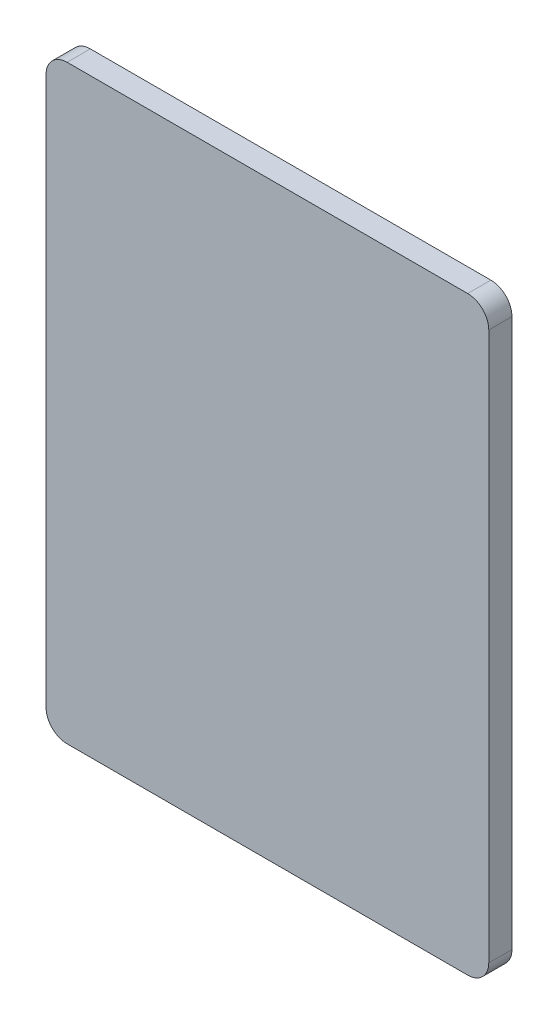
ISO-10303-21;
HEADER;
FILE_DESCRIPTION(('STEP AP214'),'2;1');
FILE_NAME('part.step','',(''),(''),'','','');
FILE_SCHEMA(('AUTOMOTIVE_DESIGN { 1 0 10303 214 1 1 1 1 }'));
ENDSEC;
DATA;
#1=APPLICATION_CONTEXT('core data for automotive mechanical design processes');
#2=APPLICATION_PROTOCOL_DEFINITION('international standard','automotive_design',2000,#1);
#3=PRODUCT_CONTEXT('',#1,'mechanical');
#4=PRODUCT('Part','Part','',(#3));
#5=PRODUCT_RELATED_PRODUCT_CATEGORY('part','',(#4));
#6=PRODUCT_DEFINITION_FORMATION('','',#4);
#7=PRODUCT_DEFINITION_CONTEXT('part definition',#1,'design');
#8=PRODUCT_DEFINITION('design','',#6,#7);
#9=PRODUCT_DEFINITION_SHAPE('','',#8);
#10=(LENGTH_UNIT() NAMED_UNIT(*) SI_UNIT(.MILLI.,.METRE.));
#11=(NAMED_UNIT(*) PLANE_ANGLE_UNIT() SI_UNIT($,.RADIAN.));
#12=(NAMED_UNIT(*) SI_UNIT($,.STERADIAN.) SOLID_ANGLE_UNIT());
#13=UNCERTAINTY_MEASURE_WITH_UNIT(LENGTH_MEASURE(1.E-05),#10,'distance_accuracy_value','');
#14=(GEOMETRIC_REPRESENTATION_CONTEXT(3) GLOBAL_UNCERTAINTY_ASSIGNED_CONTEXT((#13)) GLOBAL_UNIT_ASSIGNED_CONTEXT((#10,
#11,#12)) REPRESENTATION_CONTEXT('',''));
#15=CARTESIAN_POINT('',(0.,0.,0.));
#16=DIRECTION('',(0.,0.,1.));
#17=DIRECTION('',(1.,0.,0.));
#18=AXIS2_PLACEMENT_3D('',#15,#16,#17);
#19=CARTESIAN_POINT('',(105.,140.,11.));
#20=DIRECTION('',(-1.,0.,0.));
#21=DIRECTION('',(0.,0.,1.));
#22=AXIS2_PLACEMENT_3D('',#19,#20,#21);
#23=PLANE('',#22);
#24=DIRECTION('',(0.,1.,0.));
#25=VECTOR('',#24,1.);
#26=CARTESIAN_POINT('',(105.,140.,0.));
#27=LINE('',#26,#25);
#28=CARTESIAN_POINT('',(105.,-130.,0.));
#29=VERTEX_POINT('',#28);
#30=CARTESIAN_POINT('',(105.,130.,0.));
#31=VERTEX_POINT('',#30);
#32=EDGE_CURVE('E157',#29,#31,#27,.T.);
#33=ORIENTED_EDGE('',*,*,#32,.T.);
#34=DIRECTION('',(0.,0.,-1.));
#35=VECTOR('',#34,1.);
#36=CARTESIAN_POINT('',(105.,130.,11.));
#37=LINE('',#36,#35);
#38=CARTESIAN_POINT('',(105.,130.,11.));
#39=VERTEX_POINT('',#38);
#40=EDGE_CURVE('E11',#31,#39,#37,.F.);
#41=ORIENTED_EDGE('',*,*,#40,.T.);
#42=DIRECTION('',(0.,1.,0.));
#43=VECTOR('',#42,1.);
#44=CARTESIAN_POINT('',(105.,140.,11.));
#45=LINE('',#44,#43);
#46=CARTESIAN_POINT('',(105.,-130.,11.));
#47=VERTEX_POINT('',#46);
#48=EDGE_CURVE('E125',#47,#39,#45,.T.);
#49=ORIENTED_EDGE('',*,*,#48,.F.);
#50=DIRECTION('',(0.,0.,-1.));
#51=VECTOR('',#50,1.);
#52=CARTESIAN_POINT('',(105.,-130.,11.));
#53=LINE('',#52,#51);
#54=EDGE_CURVE('E41',#47,#29,#53,.T.);
#55=ORIENTED_EDGE('',*,*,#54,.T.);
#56=EDGE_LOOP('',(#33,#41,#49,#55));
#57=FACE_BOUND('',#56,.T.);
#58=ADVANCED_FACE('F33',(#57),#23,.F.);
#59=CARTESIAN_POINT('',(-105.,140.,11.));
#60=DIRECTION('',(0.,-1.,0.));
#61=DIRECTION('',(0.,0.,-1.));
#62=AXIS2_PLACEMENT_3D('',#59,#60,#61);
#63=PLANE('',#62);
#64=DIRECTION('',(-1.,0.,0.));
#65=VECTOR('',#64,1.);
#66=CARTESIAN_POINT('',(-105.,140.,0.));
#67=LINE('',#66,#65);
#68=CARTESIAN_POINT('',(95.,140.,0.));
#69=VERTEX_POINT('',#68);
#70=CARTESIAN_POINT('',(-95.,140.,0.));
#71=VERTEX_POINT('',#70);
#72=EDGE_CURVE('E130',#69,#71,#67,.T.);
#73=ORIENTED_EDGE('',*,*,#72,.T.);
#74=DIRECTION('',(0.,0.,-1.));
#75=VECTOR('',#74,1.);
#76=CARTESIAN_POINT('',(-95.,140.,11.));
#77=LINE('',#76,#75);
#78=CARTESIAN_POINT('',(-95.,140.,11.));
#79=VERTEX_POINT('',#78);
#80=EDGE_CURVE('E48',#71,#79,#77,.F.);
#81=ORIENTED_EDGE('',*,*,#80,.T.);
#82=DIRECTION('',(-1.,0.,0.));
#83=VECTOR('',#82,1.);
#84=CARTESIAN_POINT('',(-105.,140.,11.));
#85=LINE('',#84,#83);
#86=CARTESIAN_POINT('',(95.,140.,11.));
#87=VERTEX_POINT('',#86);
#88=EDGE_CURVE('E128',#87,#79,#85,.T.);
#89=ORIENTED_EDGE('',*,*,#88,.F.);
#90=DIRECTION('',(0.,0.,-1.));
#91=VECTOR('',#90,1.);
#92=CARTESIAN_POINT('',(95.,140.,11.));
#93=LINE('',#92,#91);
#94=EDGE_CURVE('E149',#87,#69,#93,.T.);
#95=ORIENTED_EDGE('',*,*,#94,.T.);
#96=EDGE_LOOP('',(#73,#81,#89,#95));
#97=FACE_BOUND('',#96,.T.);
#98=ADVANCED_FACE('F177',(#97),#63,.F.);
#99=CARTESIAN_POINT('',(-105.,140.,11.));
#100=DIRECTION('',(1.,0.,0.));
#101=DIRECTION('',(0.,1.,0.));
#102=AXIS2_PLACEMENT_3D('',#99,#100,#101);
#103=PLANE('',#102);
#104=DIRECTION('',(0.,-1.,0.));
#105=VECTOR('',#104,1.);
#106=CARTESIAN_POINT('',(-105.,140.,0.));
#107=LINE('',#106,#105);
#108=CARTESIAN_POINT('',(-105.,130.,0.));
#109=VERTEX_POINT('',#108);
#110=CARTESIAN_POINT('',(-105.,-130.,0.));
#111=VERTEX_POINT('',#110);
#112=EDGE_CURVE('E126',#109,#111,#107,.T.);
#113=ORIENTED_EDGE('',*,*,#112,.T.);
#114=DIRECTION('',(0.,0.,-1.));
#115=VECTOR('',#114,1.);
#116=CARTESIAN_POINT('',(-105.,-130.,11.));
#117=LINE('',#116,#115);
#118=CARTESIAN_POINT('',(-105.,-130.,11.));
#119=VERTEX_POINT('',#118);
#120=EDGE_CURVE('E104',#111,#119,#117,.F.);
#121=ORIENTED_EDGE('',*,*,#120,.T.);
#122=DIRECTION('',(0.,-1.,0.));
#123=VECTOR('',#122,1.);
#124=CARTESIAN_POINT('',(-105.,140.,11.));
#125=LINE('',#124,#123);
#126=CARTESIAN_POINT('',(-105.,130.,11.));
#127=VERTEX_POINT('',#126);
#128=EDGE_CURVE('E165',#127,#119,#125,.T.);
#129=ORIENTED_EDGE('',*,*,#128,.F.);
#130=DIRECTION('',(0.,0.,-1.));
#131=VECTOR('',#130,1.);
#132=CARTESIAN_POINT('',(-105.,130.,11.));
#133=LINE('',#132,#131);
#134=EDGE_CURVE('E109',#127,#109,#133,.T.);
#135=ORIENTED_EDGE('',*,*,#134,.T.);
#136=EDGE_LOOP('',(#113,#121,#129,#135));
#137=FACE_BOUND('',#136,.T.);
#138=ADVANCED_FACE('F176',(#137),#103,.F.);
#139=CARTESIAN_POINT('',(-105.,-140.,11.));
#140=DIRECTION('',(0.,1.,0.));
#141=DIRECTION('',(0.,0.,1.));
#142=AXIS2_PLACEMENT_3D('',#139,#140,#141);
#143=PLANE('',#142);
#144=DIRECTION('',(1.,0.,0.));
#145=VECTOR('',#144,1.);
#146=CARTESIAN_POINT('',(-105.,-140.,11.));
#147=LINE('',#146,#145);
#148=CARTESIAN_POINT('',(-95.,-140.,11.));
#149=VERTEX_POINT('',#148);
#150=CARTESIAN_POINT('',(95.,-140.,11.));
#151=VERTEX_POINT('',#150);
#152=EDGE_CURVE('E119',#149,#151,#147,.T.);
#153=ORIENTED_EDGE('',*,*,#152,.F.);
#154=DIRECTION('',(0.,0.,-1.));
#155=VECTOR('',#154,1.);
#156=CARTESIAN_POINT('',(-95.,-140.,11.));
#157=LINE('',#156,#155);
#158=CARTESIAN_POINT('',(-95.,-140.,0.));
#159=VERTEX_POINT('',#158);
#160=EDGE_CURVE('E103',#149,#159,#157,.T.);
#161=ORIENTED_EDGE('',*,*,#160,.T.);
#162=DIRECTION('',(1.,0.,0.));
#163=VECTOR('',#162,1.);
#164=CARTESIAN_POINT('',(-105.,-140.,0.));
#165=LINE('',#164,#163);
#166=CARTESIAN_POINT('',(95.,-140.,0.));
#167=VERTEX_POINT('',#166);
#168=EDGE_CURVE('E116',#159,#167,#165,.T.);
#169=ORIENTED_EDGE('',*,*,#168,.T.);
#170=DIRECTION('',(0.,0.,-1.));
#171=VECTOR('',#170,1.);
#172=CARTESIAN_POINT('',(95.,-140.,11.));
#173=LINE('',#172,#171);
#174=EDGE_CURVE('E121',#167,#151,#173,.F.);
#175=ORIENTED_EDGE('',*,*,#174,.T.);
#176=EDGE_LOOP('',(#153,#161,#169,#175));
#177=FACE_BOUND('',#176,.T.);
#178=ADVANCED_FACE('F115',(#177),#143,.F.);
#179=CARTESIAN_POINT('',(0.,0.,11.));
#180=DIRECTION('',(0.,0.,1.));
#181=DIRECTION('',(1.,0.,0.));
#182=AXIS2_PLACEMENT_3D('',#179,#180,#181);
#183=PLANE('',#182);
#184=ORIENTED_EDGE('',*,*,#128,.T.);
#185=CARTESIAN_POINT('',(-95.,-130.,11.));
#186=DIRECTION('',(0.,0.,1.));
#187=DIRECTION('',(1.,0.,0.));
#188=AXIS2_PLACEMENT_3D('',#185,#186,#187);
#189=CIRCLE('',#188,10.);
#190=EDGE_CURVE('E147',#119,#149,#189,.T.);
#191=ORIENTED_EDGE('',*,*,#190,.T.);
#192=ORIENTED_EDGE('',*,*,#152,.T.);
#193=CARTESIAN_POINT('',(95.,-130.,11.));
#194=DIRECTION('',(0.,0.,1.));
#195=DIRECTION('',(1.,0.,0.));
#196=AXIS2_PLACEMENT_3D('',#193,#194,#195);
#197=CIRCLE('',#196,10.);
#198=EDGE_CURVE('E142',#151,#47,#197,.T.);
#199=ORIENTED_EDGE('',*,*,#198,.T.);
#200=ORIENTED_EDGE('',*,*,#48,.T.);
#201=CARTESIAN_POINT('',(95.,130.,11.));
#202=DIRECTION('',(0.,0.,1.));
#203=DIRECTION('',(1.,0.,0.));
#204=AXIS2_PLACEMENT_3D('',#201,#202,#203);
#205=CIRCLE('',#204,10.);
#206=EDGE_CURVE('E55',#39,#87,#205,.T.);
#207=ORIENTED_EDGE('',*,*,#206,.T.);
#208=ORIENTED_EDGE('',*,*,#88,.T.);
#209=CARTESIAN_POINT('',(-95.,130.,11.));
#210=DIRECTION('',(0.,0.,1.));
#211=DIRECTION('',(1.,0.,0.));
#212=AXIS2_PLACEMENT_3D('',#209,#210,#211);
#213=CIRCLE('',#212,10.);
#214=EDGE_CURVE('E145',#79,#127,#213,.T.);
#215=ORIENTED_EDGE('',*,*,#214,.T.);
#216=EDGE_LOOP('',(#184,#191,#192,#199,#200,#207,#208,#215));
#217=FACE_BOUND('',#216,.T.);
#218=ADVANCED_FACE('F169',(#217),#183,.T.);
#219=CARTESIAN_POINT('',(0.,0.,0.));
#220=DIRECTION('',(0.,0.,1.));
#221=DIRECTION('',(1.,0.,0.));
#222=AXIS2_PLACEMENT_3D('',#219,#220,#221);
#223=PLANE('',#222);
#224=ORIENTED_EDGE('',*,*,#168,.F.);
#225=CARTESIAN_POINT('',(-95.,-130.,0.));
#226=DIRECTION('',(0.,0.,1.));
#227=DIRECTION('',(1.,0.,0.));
#228=AXIS2_PLACEMENT_3D('',#225,#226,#227);
#229=CIRCLE('',#228,10.);
#230=EDGE_CURVE('E99',#159,#111,#229,.F.);
#231=ORIENTED_EDGE('',*,*,#230,.T.);
#232=ORIENTED_EDGE('',*,*,#112,.F.);
#233=CARTESIAN_POINT('',(-95.,130.,0.));
#234=DIRECTION('',(0.,0.,1.));
#235=DIRECTION('',(1.,0.,0.));
#236=AXIS2_PLACEMENT_3D('',#233,#234,#235);
#237=CIRCLE('',#236,10.);
#238=EDGE_CURVE('E110',#109,#71,#237,.F.);
#239=ORIENTED_EDGE('',*,*,#238,.T.);
#240=ORIENTED_EDGE('',*,*,#72,.F.);
#241=CARTESIAN_POINT('',(95.,130.,0.));
#242=DIRECTION('',(0.,0.,1.));
#243=DIRECTION('',(1.,0.,0.));
#244=AXIS2_PLACEMENT_3D('',#241,#242,#243);
#245=CIRCLE('',#244,10.);
#246=EDGE_CURVE('E136',#69,#31,#245,.F.);
#247=ORIENTED_EDGE('',*,*,#246,.T.);
#248=ORIENTED_EDGE('',*,*,#32,.F.);
#249=CARTESIAN_POINT('',(95.,-130.,0.));
#250=DIRECTION('',(0.,0.,1.));
#251=DIRECTION('',(1.,0.,0.));
#252=AXIS2_PLACEMENT_3D('',#249,#250,#251);
#253=CIRCLE('',#252,10.);
#254=EDGE_CURVE('E120',#29,#167,#253,.F.);
#255=ORIENTED_EDGE('',*,*,#254,.T.);
#256=EDGE_LOOP('',(#224,#231,#232,#239,#240,#247,#248,#255));
#257=FACE_BOUND('',#256,.T.);
#258=ADVANCED_FACE('F123',(#257),#223,.F.);
#259=CARTESIAN_POINT('',(-95.,-130.,11.));
#260=DIRECTION('',(0.,0.,-1.));
#261=DIRECTION('',(-1.,0.,0.));
#262=AXIS2_PLACEMENT_3D('',#259,#260,#261);
#263=CYLINDRICAL_SURFACE('',#262,10.);
#264=ORIENTED_EDGE('',*,*,#190,.F.);
#265=ORIENTED_EDGE('',*,*,#120,.F.);
#266=ORIENTED_EDGE('',*,*,#230,.F.);
#267=ORIENTED_EDGE('',*,*,#160,.F.);
#268=EDGE_LOOP('',(#264,#265,#266,#267));
#269=FACE_BOUND('',#268,.T.);
#270=ADVANCED_FACE('F102',(#269),#263,.T.);
#271=CARTESIAN_POINT('',(-95.,130.,11.));
#272=DIRECTION('',(0.,0.,-1.));
#273=DIRECTION('',(-1.,0.,0.));
#274=AXIS2_PLACEMENT_3D('',#271,#272,#273);
#275=CYLINDRICAL_SURFACE('',#274,10.);
#276=ORIENTED_EDGE('',*,*,#214,.F.);
#277=ORIENTED_EDGE('',*,*,#80,.F.);
#278=ORIENTED_EDGE('',*,*,#238,.F.);
#279=ORIENTED_EDGE('',*,*,#134,.F.);
#280=EDGE_LOOP('',(#276,#277,#278,#279));
#281=FACE_BOUND('',#280,.T.);
#282=ADVANCED_FACE('F174',(#281),#275,.T.);
#283=CARTESIAN_POINT('',(95.,130.,11.));
#284=DIRECTION('',(0.,0.,-1.));
#285=DIRECTION('',(-1.,0.,0.));
#286=AXIS2_PLACEMENT_3D('',#283,#284,#285);
#287=CYLINDRICAL_SURFACE('',#286,10.);
#288=ORIENTED_EDGE('',*,*,#206,.F.);
#289=ORIENTED_EDGE('',*,*,#40,.F.);
#290=ORIENTED_EDGE('',*,*,#246,.F.);
#291=ORIENTED_EDGE('',*,*,#94,.F.);
#292=EDGE_LOOP('',(#288,#289,#290,#291));
#293=FACE_BOUND('',#292,.T.);
#294=ADVANCED_FACE('F179',(#293),#287,.T.);
#295=CARTESIAN_POINT('',(95.,-130.,11.));
#296=DIRECTION('',(0.,0.,-1.));
#297=DIRECTION('',(-1.,0.,0.));
#298=AXIS2_PLACEMENT_3D('',#295,#296,#297);
#299=CYLINDRICAL_SURFACE('',#298,10.);
#300=ORIENTED_EDGE('',*,*,#198,.F.);
#301=ORIENTED_EDGE('',*,*,#174,.F.);
#302=ORIENTED_EDGE('',*,*,#254,.F.);
#303=ORIENTED_EDGE('',*,*,#54,.F.);
#304=EDGE_LOOP('',(#300,#301,#302,#303));
#305=FACE_BOUND('',#304,.T.);
#306=ADVANCED_FACE('F35',(#305),#299,.T.);
#307=CLOSED_SHELL('',(#58,#98,#138,#178,#218,#258,#270,#282,#294,#306));
#308=MANIFOLD_SOLID_BREP('B2',#307);
#309=ADVANCED_BREP_SHAPE_REPRESENTATION('',(#18,#308),#14);
#310=SHAPE_DEFINITION_REPRESENTATION(#9,#309);
ENDSEC;
END-ISO-10303-21;
